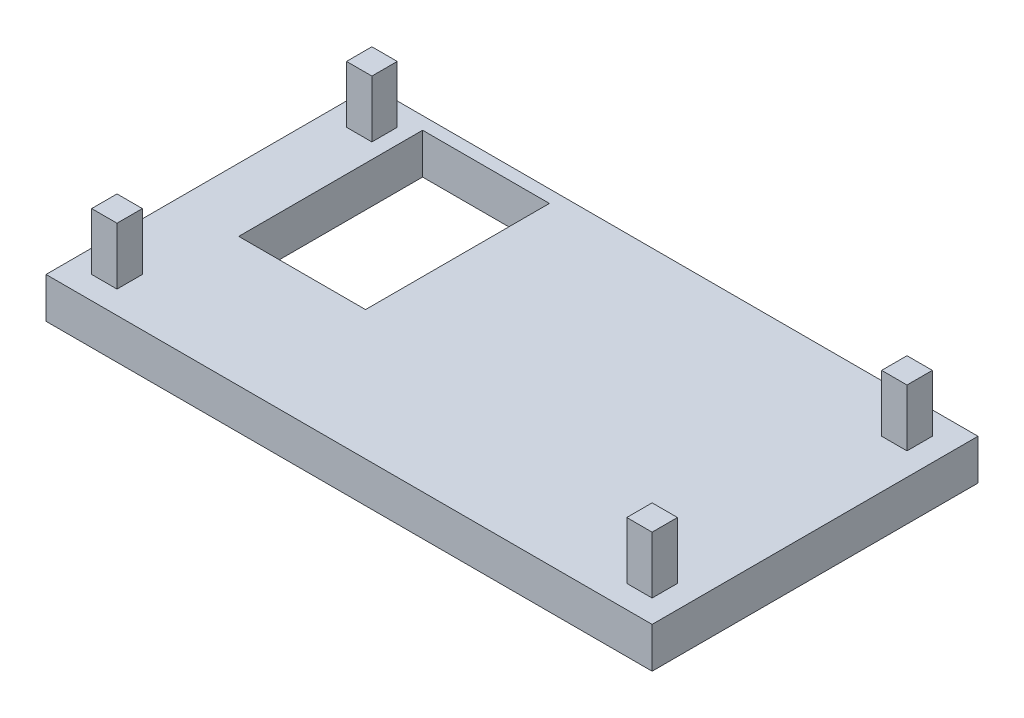
ISO-10303-21;
HEADER;
FILE_DESCRIPTION(('STEP AP214'),'2;1');
FILE_NAME('part.step','',(''),(''),'','','');
FILE_SCHEMA(('AUTOMOTIVE_DESIGN { 1 0 10303 214 1 1 1 1 }'));
ENDSEC;
DATA;
#1=APPLICATION_CONTEXT('core data for automotive mechanical design processes');
#2=APPLICATION_PROTOCOL_DEFINITION('international standard','automotive_design',2000,#1);
#3=PRODUCT_CONTEXT('',#1,'mechanical');
#4=PRODUCT('Part','Part','',(#3));
#5=PRODUCT_RELATED_PRODUCT_CATEGORY('part','',(#4));
#6=PRODUCT_DEFINITION_FORMATION('','',#4);
#7=PRODUCT_DEFINITION_CONTEXT('part definition',#1,'design');
#8=PRODUCT_DEFINITION('design','',#6,#7);
#9=PRODUCT_DEFINITION_SHAPE('','',#8);
#10=(LENGTH_UNIT() NAMED_UNIT(*) SI_UNIT(.MILLI.,.METRE.));
#11=(NAMED_UNIT(*) PLANE_ANGLE_UNIT() SI_UNIT($,.RADIAN.));
#12=(NAMED_UNIT(*) SI_UNIT($,.STERADIAN.) SOLID_ANGLE_UNIT());
#13=UNCERTAINTY_MEASURE_WITH_UNIT(LENGTH_MEASURE(1.E-05),#10,'distance_accuracy_value','');
#14=(GEOMETRIC_REPRESENTATION_CONTEXT(3) GLOBAL_UNCERTAINTY_ASSIGNED_CONTEXT((#13)) GLOBAL_UNIT_ASSIGNED_CONTEXT((#10,
#11,#12)) REPRESENTATION_CONTEXT('',''));
#15=CARTESIAN_POINT('',(0.,0.,0.));
#16=DIRECTION('',(0.,0.,1.));
#17=DIRECTION('',(1.,0.,0.));
#18=AXIS2_PLACEMENT_3D('',#15,#16,#17);
#19=CARTESIAN_POINT('',(0.,3.2,0.));
#20=DIRECTION('',(0.,-1.,0.));
#21=DIRECTION('',(0.,0.,-1.));
#22=AXIS2_PLACEMENT_3D('',#19,#20,#21);
#23=PLANE('',#22);
#24=DIRECTION('',(1.,0.,0.));
#25=VECTOR('',#24,1.);
#26=CARTESIAN_POINT('',(0.,3.2,-11.85));
#27=LINE('',#26,#25);
#28=CARTESIAN_POINT('',(-18.9,3.2,-11.85));
#29=VERTEX_POINT('',#28);
#30=CARTESIAN_POINT('',(-8.89999999999999,3.2,-11.85));
#31=VERTEX_POINT('',#30);
#32=EDGE_CURVE('E225',#29,#31,#27,.T.);
#33=ORIENTED_EDGE('',*,*,#32,.T.);
#34=DIRECTION('',(0.,0.,1.));
#35=VECTOR('',#34,1.);
#36=CARTESIAN_POINT('',(-8.89999999999999,3.2,0.));
#37=LINE('',#36,#35);
#38=CARTESIAN_POINT('',(-8.89999999999999,3.2,2.65));
#39=VERTEX_POINT('',#38);
#40=EDGE_CURVE('E228',#31,#39,#37,.T.);
#41=ORIENTED_EDGE('',*,*,#40,.T.);
#42=DIRECTION('',(-1.,0.,0.));
#43=VECTOR('',#42,1.);
#44=CARTESIAN_POINT('',(0.,3.2,2.65));
#45=LINE('',#44,#43);
#46=CARTESIAN_POINT('',(-18.9,3.2,2.65));
#47=VERTEX_POINT('',#46);
#48=EDGE_CURVE('E220',#39,#47,#45,.T.);
#49=ORIENTED_EDGE('',*,*,#48,.T.);
#50=DIRECTION('',(0.,0.,-1.));
#51=VECTOR('',#50,1.);
#52=CARTESIAN_POINT('',(-18.9,3.2,0.));
#53=LINE('',#52,#51);
#54=EDGE_CURVE('E200',#47,#29,#53,.T.);
#55=ORIENTED_EDGE('',*,*,#54,.T.);
#56=EDGE_LOOP('',(#33,#41,#49,#55));
#57=FACE_BOUND('',#56,.T.);
#58=DIRECTION('',(0.,0.,1.));
#59=VECTOR('',#58,1.);
#60=CARTESIAN_POINT('',(-22.1,3.2,-11.05));
#61=LINE('',#60,#59);
#62=CARTESIAN_POINT('',(-22.1,3.2,-11.05));
#63=VERTEX_POINT('',#62);
#64=CARTESIAN_POINT('',(-22.1,3.2,-9.04999999999999));
#65=VERTEX_POINT('',#64);
#66=EDGE_CURVE('E264',#63,#65,#61,.T.);
#67=ORIENTED_EDGE('',*,*,#66,.F.);
#68=DIRECTION('',(-1.,0.,0.));
#69=VECTOR('',#68,1.);
#70=CARTESIAN_POINT('',(-22.1,3.2,-11.05));
#71=LINE('',#70,#69);
#72=CARTESIAN_POINT('',(-20.1,3.2,-11.05));
#73=VERTEX_POINT('',#72);
#74=EDGE_CURVE('E269',#73,#63,#71,.T.);
#75=ORIENTED_EDGE('',*,*,#74,.F.);
#76=DIRECTION('',(0.,0.,-1.));
#77=VECTOR('',#76,1.);
#78=CARTESIAN_POINT('',(-20.1,3.2,-11.05));
#79=LINE('',#78,#77);
#80=CARTESIAN_POINT('',(-20.1,3.2,-9.04999999999999));
#81=VERTEX_POINT('',#80);
#82=EDGE_CURVE('E281',#81,#73,#79,.T.);
#83=ORIENTED_EDGE('',*,*,#82,.F.);
#84=DIRECTION('',(1.,0.,0.));
#85=VECTOR('',#84,1.);
#86=CARTESIAN_POINT('',(-22.1,3.2,-9.04999999999999));
#87=LINE('',#86,#85);
#88=EDGE_CURVE('E278',#65,#81,#87,.T.);
#89=ORIENTED_EDGE('',*,*,#88,.F.);
#90=EDGE_LOOP('',(#67,#75,#83,#89));
#91=FACE_BOUND('',#90,.T.);
#92=DIRECTION('',(0.,0.,1.));
#93=VECTOR('',#92,1.);
#94=CARTESIAN_POINT('',(20.1,3.2,11.05));
#95=LINE('',#94,#93);
#96=CARTESIAN_POINT('',(20.1,3.2,9.04999999999999));
#97=VERTEX_POINT('',#96);
#98=CARTESIAN_POINT('',(20.1,3.2,11.05));
#99=VERTEX_POINT('',#98);
#100=EDGE_CURVE('E330',#97,#99,#95,.T.);
#101=ORIENTED_EDGE('',*,*,#100,.F.);
#102=DIRECTION('',(-1.,0.,0.));
#103=VECTOR('',#102,1.);
#104=CARTESIAN_POINT('',(22.1,3.2,9.04999999999999));
#105=LINE('',#104,#103);
#106=CARTESIAN_POINT('',(22.1,3.2,9.04999999999999));
#107=VERTEX_POINT('',#106);
#108=EDGE_CURVE('E335',#107,#97,#105,.T.);
#109=ORIENTED_EDGE('',*,*,#108,.F.);
#110=DIRECTION('',(0.,0.,-1.));
#111=VECTOR('',#110,1.);
#112=CARTESIAN_POINT('',(22.1,3.2,11.05));
#113=LINE('',#112,#111);
#114=CARTESIAN_POINT('',(22.1,3.2,11.05));
#115=VERTEX_POINT('',#114);
#116=EDGE_CURVE('E347',#115,#107,#113,.T.);
#117=ORIENTED_EDGE('',*,*,#116,.F.);
#118=DIRECTION('',(1.,0.,0.));
#119=VECTOR('',#118,1.);
#120=CARTESIAN_POINT('',(22.1,3.2,11.05));
#121=LINE('',#120,#119);
#122=EDGE_CURVE('E344',#99,#115,#121,.T.);
#123=ORIENTED_EDGE('',*,*,#122,.F.);
#124=EDGE_LOOP('',(#101,#109,#117,#123));
#125=FACE_BOUND('',#124,.T.);
#126=DIRECTION('',(0.,0.,-1.));
#127=VECTOR('',#126,1.);
#128=CARTESIAN_POINT('',(23.9,3.2,12.85));
#129=LINE('',#128,#127);
#130=CARTESIAN_POINT('',(23.9,3.2,12.85));
#131=VERTEX_POINT('',#130);
#132=CARTESIAN_POINT('',(23.9,3.2,-12.85));
#133=VERTEX_POINT('',#132);
#134=EDGE_CURVE('E364',#131,#133,#129,.T.);
#135=ORIENTED_EDGE('',*,*,#134,.T.);
#136=DIRECTION('',(-1.,0.,0.));
#137=VECTOR('',#136,1.);
#138=CARTESIAN_POINT('',(-23.9,3.2,-12.85));
#139=LINE('',#138,#137);
#140=CARTESIAN_POINT('',(-23.9,3.2,-12.85));
#141=VERTEX_POINT('',#140);
#142=EDGE_CURVE('E367',#133,#141,#139,.T.);
#143=ORIENTED_EDGE('',*,*,#142,.T.);
#144=DIRECTION('',(0.,0.,1.));
#145=VECTOR('',#144,1.);
#146=CARTESIAN_POINT('',(-23.9,3.2,12.85));
#147=LINE('',#146,#145);
#148=CARTESIAN_POINT('',(-23.9,3.2,12.85));
#149=VERTEX_POINT('',#148);
#150=EDGE_CURVE('E370',#141,#149,#147,.T.);
#151=ORIENTED_EDGE('',*,*,#150,.T.);
#152=DIRECTION('',(1.,0.,0.));
#153=VECTOR('',#152,1.);
#154=CARTESIAN_POINT('',(-23.9,3.2,12.85));
#155=LINE('',#154,#153);
#156=EDGE_CURVE('E372',#149,#131,#155,.T.);
#157=ORIENTED_EDGE('',*,*,#156,.T.);
#158=EDGE_LOOP('',(#135,#143,#151,#157));
#159=FACE_BOUND('',#158,.T.);
#160=DIRECTION('',(0.,0.,-1.));
#161=VECTOR('',#160,1.);
#162=CARTESIAN_POINT('',(22.1,3.2,-11.05));
#163=LINE('',#162,#161);
#164=CARTESIAN_POINT('',(22.1,3.2,-9.04999999999999));
#165=VERTEX_POINT('',#164);
#166=CARTESIAN_POINT('',(22.1,3.2,-11.05));
#167=VERTEX_POINT('',#166);
#168=EDGE_CURVE('E297',#165,#167,#163,.T.);
#169=ORIENTED_EDGE('',*,*,#168,.F.);
#170=DIRECTION('',(1.,0.,0.));
#171=VECTOR('',#170,1.);
#172=CARTESIAN_POINT('',(22.1,3.2,-9.04999999999999));
#173=LINE('',#172,#171);
#174=CARTESIAN_POINT('',(20.1,3.2,-9.04999999999999));
#175=VERTEX_POINT('',#174);
#176=EDGE_CURVE('E302',#175,#165,#173,.T.);
#177=ORIENTED_EDGE('',*,*,#176,.F.);
#178=DIRECTION('',(0.,0.,1.));
#179=VECTOR('',#178,1.);
#180=CARTESIAN_POINT('',(20.1,3.2,-11.05));
#181=LINE('',#180,#179);
#182=CARTESIAN_POINT('',(20.1,3.2,-11.05));
#183=VERTEX_POINT('',#182);
#184=EDGE_CURVE('E314',#183,#175,#181,.T.);
#185=ORIENTED_EDGE('',*,*,#184,.F.);
#186=DIRECTION('',(-1.,0.,0.));
#187=VECTOR('',#186,1.);
#188=CARTESIAN_POINT('',(22.1,3.2,-11.05));
#189=LINE('',#188,#187);
#190=EDGE_CURVE('E311',#167,#183,#189,.T.);
#191=ORIENTED_EDGE('',*,*,#190,.F.);
#192=EDGE_LOOP('',(#169,#177,#185,#191));
#193=FACE_BOUND('',#192,.T.);
#194=DIRECTION('',(0.,0.,1.));
#195=VECTOR('',#194,1.);
#196=CARTESIAN_POINT('',(-22.1,3.2,11.05));
#197=LINE('',#196,#195);
#198=CARTESIAN_POINT('',(-22.1,3.2,9.05));
#199=VERTEX_POINT('',#198);
#200=CARTESIAN_POINT('',(-22.1,3.2,11.05));
#201=VERTEX_POINT('',#200);
#202=EDGE_CURVE('E231',#199,#201,#197,.T.);
#203=ORIENTED_EDGE('',*,*,#202,.F.);
#204=DIRECTION('',(-1.,0.,0.));
#205=VECTOR('',#204,1.);
#206=CARTESIAN_POINT('',(-22.1,3.2,9.05));
#207=LINE('',#206,#205);
#208=CARTESIAN_POINT('',(-20.1,3.2,9.05));
#209=VERTEX_POINT('',#208);
#210=EDGE_CURVE('E236',#209,#199,#207,.T.);
#211=ORIENTED_EDGE('',*,*,#210,.F.);
#212=DIRECTION('',(0.,0.,-1.));
#213=VECTOR('',#212,1.);
#214=CARTESIAN_POINT('',(-20.1,3.2,11.05));
#215=LINE('',#214,#213);
#216=CARTESIAN_POINT('',(-20.1,3.2,11.05));
#217=VERTEX_POINT('',#216);
#218=EDGE_CURVE('E248',#217,#209,#215,.T.);
#219=ORIENTED_EDGE('',*,*,#218,.F.);
#220=DIRECTION('',(1.,0.,0.));
#221=VECTOR('',#220,1.);
#222=CARTESIAN_POINT('',(-22.1,3.2,11.05));
#223=LINE('',#222,#221);
#224=EDGE_CURVE('E245',#201,#217,#223,.T.);
#225=ORIENTED_EDGE('',*,*,#224,.F.);
#226=EDGE_LOOP('',(#203,#211,#219,#225));
#227=FACE_BOUND('',#226,.T.);
#228=ADVANCED_FACE('F33',(#57,#91,#125,#159,#193,#227),#23,.F.);
#229=CARTESIAN_POINT('',(23.9,3.2,12.85));
#230=DIRECTION('',(-1.,0.,0.));
#231=DIRECTION('',(0.,0.,1.));
#232=AXIS2_PLACEMENT_3D('',#229,#230,#231);
#233=PLANE('',#232);
#234=DIRECTION('',(0.,0.,-1.));
#235=VECTOR('',#234,1.);
#236=CARTESIAN_POINT('',(23.9,0.,12.85));
#237=LINE('',#236,#235);
#238=CARTESIAN_POINT('',(23.9,0.,12.85));
#239=VERTEX_POINT('',#238);
#240=CARTESIAN_POINT('',(23.9,0.,-12.85));
#241=VERTEX_POINT('',#240);
#242=EDGE_CURVE('E363',#239,#241,#237,.T.);
#243=ORIENTED_EDGE('',*,*,#242,.T.);
#244=DIRECTION('',(0.,-1.,0.));
#245=VECTOR('',#244,1.);
#246=CARTESIAN_POINT('',(23.9,3.2,-12.85));
#247=LINE('',#246,#245);
#248=EDGE_CURVE('E11',#133,#241,#247,.T.);
#249=ORIENTED_EDGE('',*,*,#248,.F.);
#250=ORIENTED_EDGE('',*,*,#134,.F.);
#251=DIRECTION('',(0.,-1.,0.));
#252=VECTOR('',#251,1.);
#253=CARTESIAN_POINT('',(23.9,3.2,12.85));
#254=LINE('',#253,#252);
#255=EDGE_CURVE('E374',#131,#239,#254,.T.);
#256=ORIENTED_EDGE('',*,*,#255,.T.);
#257=EDGE_LOOP('',(#243,#249,#250,#256));
#258=FACE_BOUND('',#257,.T.);
#259=ADVANCED_FACE('F35',(#258),#233,.F.);
#260=CARTESIAN_POINT('',(-23.9,3.2,-12.85));
#261=DIRECTION('',(0.,0.,1.));
#262=DIRECTION('',(1.,0.,0.));
#263=AXIS2_PLACEMENT_3D('',#260,#261,#262);
#264=PLANE('',#263);
#265=DIRECTION('',(-1.,0.,0.));
#266=VECTOR('',#265,1.);
#267=CARTESIAN_POINT('',(-23.9,0.,-12.85));
#268=LINE('',#267,#266);
#269=CARTESIAN_POINT('',(-23.9,0.,-12.85));
#270=VERTEX_POINT('',#269);
#271=EDGE_CURVE('E377',#241,#270,#268,.T.);
#272=ORIENTED_EDGE('',*,*,#271,.T.);
#273=DIRECTION('',(0.,-1.,0.));
#274=VECTOR('',#273,1.);
#275=CARTESIAN_POINT('',(-23.9,3.2,-12.85));
#276=LINE('',#275,#274);
#277=EDGE_CURVE('E41',#141,#270,#276,.T.);
#278=ORIENTED_EDGE('',*,*,#277,.F.);
#279=ORIENTED_EDGE('',*,*,#142,.F.);
#280=ORIENTED_EDGE('',*,*,#248,.T.);
#281=EDGE_LOOP('',(#272,#278,#279,#280));
#282=FACE_BOUND('',#281,.T.);
#283=ADVANCED_FACE('F405',(#282),#264,.F.);
#284=CARTESIAN_POINT('',(-23.9,3.2,12.85));
#285=DIRECTION('',(1.,0.,0.));
#286=DIRECTION('',(0.,0.,-1.));
#287=AXIS2_PLACEMENT_3D('',#284,#285,#286);
#288=PLANE('',#287);
#289=DIRECTION('',(0.,0.,1.));
#290=VECTOR('',#289,1.);
#291=CARTESIAN_POINT('',(-23.9,0.,12.85));
#292=LINE('',#291,#290);
#293=CARTESIAN_POINT('',(-23.9,0.,12.85));
#294=VERTEX_POINT('',#293);
#295=EDGE_CURVE('E379',#270,#294,#292,.T.);
#296=ORIENTED_EDGE('',*,*,#295,.T.);
#297=DIRECTION('',(0.,-1.,0.));
#298=VECTOR('',#297,1.);
#299=CARTESIAN_POINT('',(-23.9,3.2,12.85));
#300=LINE('',#299,#298);
#301=EDGE_CURVE('E384',#149,#294,#300,.T.);
#302=ORIENTED_EDGE('',*,*,#301,.F.);
#303=ORIENTED_EDGE('',*,*,#150,.F.);
#304=ORIENTED_EDGE('',*,*,#277,.T.);
#305=EDGE_LOOP('',(#296,#302,#303,#304));
#306=FACE_BOUND('',#305,.T.);
#307=ADVANCED_FACE('F391',(#306),#288,.F.);
#308=CARTESIAN_POINT('',(-23.9,3.2,12.85));
#309=DIRECTION('',(0.,0.,-1.));
#310=DIRECTION('',(-1.,0.,0.));
#311=AXIS2_PLACEMENT_3D('',#308,#309,#310);
#312=PLANE('',#311);
#313=DIRECTION('',(1.,0.,0.));
#314=VECTOR('',#313,1.);
#315=CARTESIAN_POINT('',(-23.9,0.,12.85));
#316=LINE('',#315,#314);
#317=EDGE_CURVE('E368',#294,#239,#316,.T.);
#318=ORIENTED_EDGE('',*,*,#317,.T.);
#319=ORIENTED_EDGE('',*,*,#255,.F.);
#320=ORIENTED_EDGE('',*,*,#156,.F.);
#321=ORIENTED_EDGE('',*,*,#301,.T.);
#322=EDGE_LOOP('',(#318,#319,#320,#321));
#323=FACE_BOUND('',#322,.T.);
#324=ADVANCED_FACE('F398',(#323),#312,.F.);
#325=CARTESIAN_POINT('',(0.,0.,0.));
#326=DIRECTION('',(0.,-1.,0.));
#327=DIRECTION('',(0.,0.,-1.));
#328=AXIS2_PLACEMENT_3D('',#325,#326,#327);
#329=PLANE('',#328);
#330=DIRECTION('',(0.,0.,1.));
#331=VECTOR('',#330,1.);
#332=CARTESIAN_POINT('',(-8.89999999999999,0.,2.65));
#333=LINE('',#332,#331);
#334=CARTESIAN_POINT('',(-8.89999999999999,0.,-11.85));
#335=VERTEX_POINT('',#334);
#336=CARTESIAN_POINT('',(-8.89999999999999,0.,2.65));
#337=VERTEX_POINT('',#336);
#338=EDGE_CURVE('E56',#335,#337,#333,.T.);
#339=ORIENTED_EDGE('',*,*,#338,.F.);
#340=DIRECTION('',(1.,0.,0.));
#341=VECTOR('',#340,1.);
#342=CARTESIAN_POINT('',(-18.9,0.,-11.85));
#343=LINE('',#342,#341);
#344=CARTESIAN_POINT('',(-18.9,0.,-11.85));
#345=VERTEX_POINT('',#344);
#346=EDGE_CURVE('E213',#345,#335,#343,.T.);
#347=ORIENTED_EDGE('',*,*,#346,.F.);
#348=DIRECTION('',(0.,0.,-1.));
#349=VECTOR('',#348,1.);
#350=CARTESIAN_POINT('',(-18.9,0.,2.65));
#351=LINE('',#350,#349);
#352=CARTESIAN_POINT('',(-18.9,0.,2.65));
#353=VERTEX_POINT('',#352);
#354=EDGE_CURVE('E197',#353,#345,#351,.T.);
#355=ORIENTED_EDGE('',*,*,#354,.F.);
#356=DIRECTION('',(-1.,0.,0.));
#357=VECTOR('',#356,1.);
#358=CARTESIAN_POINT('',(-18.9,0.,2.65));
#359=LINE('',#358,#357);
#360=EDGE_CURVE('E206',#337,#353,#359,.T.);
#361=ORIENTED_EDGE('',*,*,#360,.F.);
#362=EDGE_LOOP('',(#339,#347,#355,#361));
#363=FACE_BOUND('',#362,.T.);
#364=ORIENTED_EDGE('',*,*,#242,.F.);
#365=ORIENTED_EDGE('',*,*,#317,.F.);
#366=ORIENTED_EDGE('',*,*,#295,.F.);
#367=ORIENTED_EDGE('',*,*,#271,.F.);
#368=EDGE_LOOP('',(#364,#365,#366,#367));
#369=FACE_BOUND('',#368,.T.);
#370=ADVANCED_FACE('F210',(#363,#369),#329,.T.);
#371=CARTESIAN_POINT('',(20.1,7.7,11.05));
#372=DIRECTION('',(1.,0.,0.));
#373=DIRECTION('',(0.,0.,-1.));
#374=AXIS2_PLACEMENT_3D('',#371,#372,#373);
#375=PLANE('',#374);
#376=ORIENTED_EDGE('',*,*,#100,.T.);
#377=DIRECTION('',(0.,-1.,0.));
#378=VECTOR('',#377,1.);
#379=CARTESIAN_POINT('',(20.1,7.7,11.05));
#380=LINE('',#379,#378);
#381=CARTESIAN_POINT('',(20.1,7.7,11.05));
#382=VERTEX_POINT('',#381);
#383=EDGE_CURVE('E360',#382,#99,#380,.T.);
#384=ORIENTED_EDGE('',*,*,#383,.F.);
#385=DIRECTION('',(0.,0.,1.));
#386=VECTOR('',#385,1.);
#387=CARTESIAN_POINT('',(20.1,7.7,11.05));
#388=LINE('',#387,#386);
#389=CARTESIAN_POINT('',(20.1,7.7,9.04999999999999));
#390=VERTEX_POINT('',#389);
#391=EDGE_CURVE('E331',#390,#382,#388,.T.);
#392=ORIENTED_EDGE('',*,*,#391,.F.);
#393=DIRECTION('',(0.,-1.,0.));
#394=VECTOR('',#393,1.);
#395=CARTESIAN_POINT('',(20.1,7.7,9.04999999999999));
#396=LINE('',#395,#394);
#397=EDGE_CURVE('E341',#390,#97,#396,.T.);
#398=ORIENTED_EDGE('',*,*,#397,.T.);
#399=EDGE_LOOP('',(#376,#384,#392,#398));
#400=FACE_BOUND('',#399,.T.);
#401=ADVANCED_FACE('F420',(#400),#375,.F.);
#402=CARTESIAN_POINT('',(22.1,7.7,11.05));
#403=DIRECTION('',(0.,0.,-1.));
#404=DIRECTION('',(-1.,0.,0.));
#405=AXIS2_PLACEMENT_3D('',#402,#403,#404);
#406=PLANE('',#405);
#407=ORIENTED_EDGE('',*,*,#122,.T.);
#408=DIRECTION('',(0.,-1.,0.));
#409=VECTOR('',#408,1.);
#410=CARTESIAN_POINT('',(22.1,7.7,11.05));
#411=LINE('',#410,#409);
#412=CARTESIAN_POINT('',(22.1,7.7,11.05));
#413=VERTEX_POINT('',#412);
#414=EDGE_CURVE('E357',#413,#115,#411,.T.);
#415=ORIENTED_EDGE('',*,*,#414,.F.);
#416=DIRECTION('',(1.,0.,0.));
#417=VECTOR('',#416,1.);
#418=CARTESIAN_POINT('',(22.1,7.7,11.05));
#419=LINE('',#418,#417);
#420=EDGE_CURVE('E334',#382,#413,#419,.T.);
#421=ORIENTED_EDGE('',*,*,#420,.F.);
#422=ORIENTED_EDGE('',*,*,#383,.T.);
#423=EDGE_LOOP('',(#407,#415,#421,#422));
#424=FACE_BOUND('',#423,.T.);
#425=ADVANCED_FACE('F440',(#424),#406,.F.);
#426=CARTESIAN_POINT('',(22.1,7.7,11.05));
#427=DIRECTION('',(-1.,0.,0.));
#428=DIRECTION('',(0.,0.,1.));
#429=AXIS2_PLACEMENT_3D('',#426,#427,#428);
#430=PLANE('',#429);
#431=ORIENTED_EDGE('',*,*,#116,.T.);
#432=DIRECTION('',(0.,-1.,0.));
#433=VECTOR('',#432,1.);
#434=CARTESIAN_POINT('',(22.1,7.7,9.04999999999999));
#435=LINE('',#434,#433);
#436=CARTESIAN_POINT('',(22.1,7.7,9.04999999999999));
#437=VERTEX_POINT('',#436);
#438=EDGE_CURVE('E354',#437,#107,#435,.T.);
#439=ORIENTED_EDGE('',*,*,#438,.F.);
#440=DIRECTION('',(0.,0.,-1.));
#441=VECTOR('',#440,1.);
#442=CARTESIAN_POINT('',(22.1,7.7,11.05));
#443=LINE('',#442,#441);
#444=EDGE_CURVE('E337',#413,#437,#443,.T.);
#445=ORIENTED_EDGE('',*,*,#444,.F.);
#446=ORIENTED_EDGE('',*,*,#414,.T.);
#447=EDGE_LOOP('',(#431,#439,#445,#446));
#448=FACE_BOUND('',#447,.T.);
#449=ADVANCED_FACE('F447',(#448),#430,.F.);
#450=CARTESIAN_POINT('',(22.1,7.7,9.04999999999999));
#451=DIRECTION('',(0.,0.,1.));
#452=DIRECTION('',(1.,0.,0.));
#453=AXIS2_PLACEMENT_3D('',#450,#451,#452);
#454=PLANE('',#453);
#455=ORIENTED_EDGE('',*,*,#108,.T.);
#456=ORIENTED_EDGE('',*,*,#397,.F.);
#457=DIRECTION('',(-1.,0.,0.));
#458=VECTOR('',#457,1.);
#459=CARTESIAN_POINT('',(22.1,7.7,9.04999999999999));
#460=LINE('',#459,#458);
#461=EDGE_CURVE('E339',#437,#390,#460,.T.);
#462=ORIENTED_EDGE('',*,*,#461,.F.);
#463=ORIENTED_EDGE('',*,*,#438,.T.);
#464=EDGE_LOOP('',(#455,#456,#462,#463));
#465=FACE_BOUND('',#464,.T.);
#466=ADVANCED_FACE('F454',(#465),#454,.F.);
#467=CARTESIAN_POINT('',(0.,7.7,0.));
#468=DIRECTION('',(0.,1.,0.));
#469=DIRECTION('',(0.,0.,1.));
#470=AXIS2_PLACEMENT_3D('',#467,#468,#469);
#471=PLANE('',#470);
#472=ORIENTED_EDGE('',*,*,#391,.T.);
#473=ORIENTED_EDGE('',*,*,#420,.T.);
#474=ORIENTED_EDGE('',*,*,#444,.T.);
#475=ORIENTED_EDGE('',*,*,#461,.T.);
#476=EDGE_LOOP('',(#472,#473,#474,#475));
#477=FACE_BOUND('',#476,.T.);
#478=ADVANCED_FACE('F462',(#477),#471,.T.);
#479=CARTESIAN_POINT('',(22.1,7.7,-11.05));
#480=DIRECTION('',(-1.,0.,0.));
#481=DIRECTION('',(0.,0.,1.));
#482=AXIS2_PLACEMENT_3D('',#479,#480,#481);
#483=PLANE('',#482);
#484=ORIENTED_EDGE('',*,*,#168,.T.);
#485=DIRECTION('',(0.,-1.,0.));
#486=VECTOR('',#485,1.);
#487=CARTESIAN_POINT('',(22.1,7.7,-11.05));
#488=LINE('',#487,#486);
#489=CARTESIAN_POINT('',(22.1,7.7,-11.05));
#490=VERTEX_POINT('',#489);
#491=EDGE_CURVE('E327',#490,#167,#488,.T.);
#492=ORIENTED_EDGE('',*,*,#491,.F.);
#493=DIRECTION('',(0.,0.,-1.));
#494=VECTOR('',#493,1.);
#495=CARTESIAN_POINT('',(22.1,7.7,-11.05));
#496=LINE('',#495,#494);
#497=CARTESIAN_POINT('',(22.1,7.7,-9.04999999999999));
#498=VERTEX_POINT('',#497);
#499=EDGE_CURVE('E298',#498,#490,#496,.T.);
#500=ORIENTED_EDGE('',*,*,#499,.F.);
#501=DIRECTION('',(0.,-1.,0.));
#502=VECTOR('',#501,1.);
#503=CARTESIAN_POINT('',(22.1,7.7,-9.04999999999999));
#504=LINE('',#503,#502);
#505=EDGE_CURVE('E308',#498,#165,#504,.T.);
#506=ORIENTED_EDGE('',*,*,#505,.T.);
#507=EDGE_LOOP('',(#484,#492,#500,#506));
#508=FACE_BOUND('',#507,.T.);
#509=ADVANCED_FACE('F470',(#508),#483,.F.);
#510=CARTESIAN_POINT('',(22.1,7.7,-11.05));
#511=DIRECTION('',(0.,0.,1.));
#512=DIRECTION('',(1.,0.,0.));
#513=AXIS2_PLACEMENT_3D('',#510,#511,#512);
#514=PLANE('',#513);
#515=ORIENTED_EDGE('',*,*,#190,.T.);
#516=DIRECTION('',(0.,-1.,0.));
#517=VECTOR('',#516,1.);
#518=CARTESIAN_POINT('',(20.1,7.7,-11.05));
#519=LINE('',#518,#517);
#520=CARTESIAN_POINT('',(20.1,7.7,-11.05));
#521=VERTEX_POINT('',#520);
#522=EDGE_CURVE('E324',#521,#183,#519,.T.);
#523=ORIENTED_EDGE('',*,*,#522,.F.);
#524=DIRECTION('',(-1.,0.,0.));
#525=VECTOR('',#524,1.);
#526=CARTESIAN_POINT('',(22.1,7.7,-11.05));
#527=LINE('',#526,#525);
#528=EDGE_CURVE('E301',#490,#521,#527,.T.);
#529=ORIENTED_EDGE('',*,*,#528,.F.);
#530=ORIENTED_EDGE('',*,*,#491,.T.);
#531=EDGE_LOOP('',(#515,#523,#529,#530));
#532=FACE_BOUND('',#531,.T.);
#533=ADVANCED_FACE('F478',(#532),#514,.F.);
#534=CARTESIAN_POINT('',(20.1,7.7,-11.05));
#535=DIRECTION('',(1.,0.,0.));
#536=DIRECTION('',(0.,0.,-1.));
#537=AXIS2_PLACEMENT_3D('',#534,#535,#536);
#538=PLANE('',#537);
#539=ORIENTED_EDGE('',*,*,#184,.T.);
#540=DIRECTION('',(0.,-1.,0.));
#541=VECTOR('',#540,1.);
#542=CARTESIAN_POINT('',(20.1,7.7,-9.04999999999999));
#543=LINE('',#542,#541);
#544=CARTESIAN_POINT('',(20.1,7.7,-9.04999999999999));
#545=VERTEX_POINT('',#544);
#546=EDGE_CURVE('E321',#545,#175,#543,.T.);
#547=ORIENTED_EDGE('',*,*,#546,.F.);
#548=DIRECTION('',(0.,0.,1.));
#549=VECTOR('',#548,1.);
#550=CARTESIAN_POINT('',(20.1,7.7,-11.05));
#551=LINE('',#550,#549);
#552=EDGE_CURVE('E304',#521,#545,#551,.T.);
#553=ORIENTED_EDGE('',*,*,#552,.F.);
#554=ORIENTED_EDGE('',*,*,#522,.T.);
#555=EDGE_LOOP('',(#539,#547,#553,#554));
#556=FACE_BOUND('',#555,.T.);
#557=ADVANCED_FACE('F486',(#556),#538,.F.);
#558=CARTESIAN_POINT('',(22.1,7.7,-9.04999999999999));
#559=DIRECTION('',(0.,0.,-1.));
#560=DIRECTION('',(-1.,0.,0.));
#561=AXIS2_PLACEMENT_3D('',#558,#559,#560);
#562=PLANE('',#561);
#563=ORIENTED_EDGE('',*,*,#176,.T.);
#564=ORIENTED_EDGE('',*,*,#505,.F.);
#565=DIRECTION('',(1.,0.,0.));
#566=VECTOR('',#565,1.);
#567=CARTESIAN_POINT('',(22.1,7.7,-9.04999999999999));
#568=LINE('',#567,#566);
#569=EDGE_CURVE('E306',#545,#498,#568,.T.);
#570=ORIENTED_EDGE('',*,*,#569,.F.);
#571=ORIENTED_EDGE('',*,*,#546,.T.);
#572=EDGE_LOOP('',(#563,#564,#570,#571));
#573=FACE_BOUND('',#572,.T.);
#574=ADVANCED_FACE('F494',(#573),#562,.F.);
#575=CARTESIAN_POINT('',(0.,7.7,0.));
#576=DIRECTION('',(0.,-1.,0.));
#577=DIRECTION('',(0.,0.,-1.));
#578=AXIS2_PLACEMENT_3D('',#575,#576,#577);
#579=PLANE('',#578);
#580=ORIENTED_EDGE('',*,*,#499,.T.);
#581=ORIENTED_EDGE('',*,*,#528,.T.);
#582=ORIENTED_EDGE('',*,*,#552,.T.);
#583=ORIENTED_EDGE('',*,*,#569,.T.);
#584=EDGE_LOOP('',(#580,#581,#582,#583));
#585=FACE_BOUND('',#584,.T.);
#586=ADVANCED_FACE('F502',(#585),#579,.F.);
#587=CARTESIAN_POINT('',(-22.1,7.7,-11.05));
#588=DIRECTION('',(1.,0.,0.));
#589=DIRECTION('',(0.,0.,-1.));
#590=AXIS2_PLACEMENT_3D('',#587,#588,#589);
#591=PLANE('',#590);
#592=ORIENTED_EDGE('',*,*,#66,.T.);
#593=DIRECTION('',(0.,-1.,0.));
#594=VECTOR('',#593,1.);
#595=CARTESIAN_POINT('',(-22.1,7.7,-9.04999999999999));
#596=LINE('',#595,#594);
#597=CARTESIAN_POINT('',(-22.1,7.7,-9.04999999999999));
#598=VERTEX_POINT('',#597);
#599=EDGE_CURVE('E294',#598,#65,#596,.T.);
#600=ORIENTED_EDGE('',*,*,#599,.F.);
#601=DIRECTION('',(0.,0.,1.));
#602=VECTOR('',#601,1.);
#603=CARTESIAN_POINT('',(-22.1,7.7,-11.05));
#604=LINE('',#603,#602);
#605=CARTESIAN_POINT('',(-22.1,7.7,-11.05));
#606=VERTEX_POINT('',#605);
#607=EDGE_CURVE('E265',#606,#598,#604,.T.);
#608=ORIENTED_EDGE('',*,*,#607,.F.);
#609=DIRECTION('',(0.,-1.,0.));
#610=VECTOR('',#609,1.);
#611=CARTESIAN_POINT('',(-22.1,7.7,-11.05));
#612=LINE('',#611,#610);
#613=EDGE_CURVE('E275',#606,#63,#612,.T.);
#614=ORIENTED_EDGE('',*,*,#613,.T.);
#615=EDGE_LOOP('',(#592,#600,#608,#614));
#616=FACE_BOUND('',#615,.T.);
#617=ADVANCED_FACE('F510',(#616),#591,.F.);
#618=CARTESIAN_POINT('',(-22.1,7.7,-9.04999999999999));
#619=DIRECTION('',(0.,0.,-1.));
#620=DIRECTION('',(-1.,0.,0.));
#621=AXIS2_PLACEMENT_3D('',#618,#619,#620);
#622=PLANE('',#621);
#623=ORIENTED_EDGE('',*,*,#88,.T.);
#624=DIRECTION('',(0.,-1.,0.));
#625=VECTOR('',#624,1.);
#626=CARTESIAN_POINT('',(-20.1,7.7,-9.04999999999999));
#627=LINE('',#626,#625);
#628=CARTESIAN_POINT('',(-20.1,7.7,-9.04999999999999));
#629=VERTEX_POINT('',#628);
#630=EDGE_CURVE('E291',#629,#81,#627,.T.);
#631=ORIENTED_EDGE('',*,*,#630,.F.);
#632=DIRECTION('',(1.,0.,0.));
#633=VECTOR('',#632,1.);
#634=CARTESIAN_POINT('',(-22.1,7.7,-9.04999999999999));
#635=LINE('',#634,#633);
#636=EDGE_CURVE('E268',#598,#629,#635,.T.);
#637=ORIENTED_EDGE('',*,*,#636,.F.);
#638=ORIENTED_EDGE('',*,*,#599,.T.);
#639=EDGE_LOOP('',(#623,#631,#637,#638));
#640=FACE_BOUND('',#639,.T.);
#641=ADVANCED_FACE('F518',(#640),#622,.F.);
#642=CARTESIAN_POINT('',(-20.1,7.7,-11.05));
#643=DIRECTION('',(-1.,0.,0.));
#644=DIRECTION('',(0.,0.,1.));
#645=AXIS2_PLACEMENT_3D('',#642,#643,#644);
#646=PLANE('',#645);
#647=ORIENTED_EDGE('',*,*,#82,.T.);
#648=DIRECTION('',(0.,-1.,0.));
#649=VECTOR('',#648,1.);
#650=CARTESIAN_POINT('',(-20.1,7.7,-11.05));
#651=LINE('',#650,#649);
#652=CARTESIAN_POINT('',(-20.1,7.7,-11.05));
#653=VERTEX_POINT('',#652);
#654=EDGE_CURVE('E288',#653,#73,#651,.T.);
#655=ORIENTED_EDGE('',*,*,#654,.F.);
#656=DIRECTION('',(0.,0.,-1.));
#657=VECTOR('',#656,1.);
#658=CARTESIAN_POINT('',(-20.1,7.7,-11.05));
#659=LINE('',#658,#657);
#660=EDGE_CURVE('E271',#629,#653,#659,.T.);
#661=ORIENTED_EDGE('',*,*,#660,.F.);
#662=ORIENTED_EDGE('',*,*,#630,.T.);
#663=EDGE_LOOP('',(#647,#655,#661,#662));
#664=FACE_BOUND('',#663,.T.);
#665=ADVANCED_FACE('F526',(#664),#646,.F.);
#666=CARTESIAN_POINT('',(-22.1,7.7,-11.05));
#667=DIRECTION('',(0.,0.,1.));
#668=DIRECTION('',(1.,0.,0.));
#669=AXIS2_PLACEMENT_3D('',#666,#667,#668);
#670=PLANE('',#669);
#671=ORIENTED_EDGE('',*,*,#74,.T.);
#672=ORIENTED_EDGE('',*,*,#613,.F.);
#673=DIRECTION('',(-1.,0.,0.));
#674=VECTOR('',#673,1.);
#675=CARTESIAN_POINT('',(-22.1,7.7,-11.05));
#676=LINE('',#675,#674);
#677=EDGE_CURVE('E273',#653,#606,#676,.T.);
#678=ORIENTED_EDGE('',*,*,#677,.F.);
#679=ORIENTED_EDGE('',*,*,#654,.T.);
#680=EDGE_LOOP('',(#671,#672,#678,#679));
#681=FACE_BOUND('',#680,.T.);
#682=ADVANCED_FACE('F534',(#681),#670,.F.);
#683=CARTESIAN_POINT('',(0.,7.7,0.));
#684=DIRECTION('',(0.,1.,0.));
#685=DIRECTION('',(0.,0.,1.));
#686=AXIS2_PLACEMENT_3D('',#683,#684,#685);
#687=PLANE('',#686);
#688=ORIENTED_EDGE('',*,*,#607,.T.);
#689=ORIENTED_EDGE('',*,*,#636,.T.);
#690=ORIENTED_EDGE('',*,*,#660,.T.);
#691=ORIENTED_EDGE('',*,*,#677,.T.);
#692=EDGE_LOOP('',(#688,#689,#690,#691));
#693=FACE_BOUND('',#692,.T.);
#694=ADVANCED_FACE('F542',(#693),#687,.T.);
#695=CARTESIAN_POINT('',(-22.1,7.7,11.05));
#696=DIRECTION('',(1.,0.,0.));
#697=DIRECTION('',(0.,0.,-1.));
#698=AXIS2_PLACEMENT_3D('',#695,#696,#697);
#699=PLANE('',#698);
#700=ORIENTED_EDGE('',*,*,#202,.T.);
#701=DIRECTION('',(0.,-1.,0.));
#702=VECTOR('',#701,1.);
#703=CARTESIAN_POINT('',(-22.1,7.7,11.05));
#704=LINE('',#703,#702);
#705=CARTESIAN_POINT('',(-22.1,7.7,11.05));
#706=VERTEX_POINT('',#705);
#707=EDGE_CURVE('E261',#706,#201,#704,.T.);
#708=ORIENTED_EDGE('',*,*,#707,.F.);
#709=DIRECTION('',(0.,0.,1.));
#710=VECTOR('',#709,1.);
#711=CARTESIAN_POINT('',(-22.1,7.7,11.05));
#712=LINE('',#711,#710);
#713=CARTESIAN_POINT('',(-22.1,7.7,9.05));
#714=VERTEX_POINT('',#713);
#715=EDGE_CURVE('E232',#714,#706,#712,.T.);
#716=ORIENTED_EDGE('',*,*,#715,.F.);
#717=DIRECTION('',(0.,-1.,0.));
#718=VECTOR('',#717,1.);
#719=CARTESIAN_POINT('',(-22.1,7.7,9.05));
#720=LINE('',#719,#718);
#721=EDGE_CURVE('E242',#714,#199,#720,.T.);
#722=ORIENTED_EDGE('',*,*,#721,.T.);
#723=EDGE_LOOP('',(#700,#708,#716,#722));
#724=FACE_BOUND('',#723,.T.);
#725=ADVANCED_FACE('F550',(#724),#699,.F.);
#726=CARTESIAN_POINT('',(-22.1,7.7,11.05));
#727=DIRECTION('',(0.,0.,-1.));
#728=DIRECTION('',(-1.,0.,0.));
#729=AXIS2_PLACEMENT_3D('',#726,#727,#728);
#730=PLANE('',#729);
#731=ORIENTED_EDGE('',*,*,#224,.T.);
#732=DIRECTION('',(0.,-1.,0.));
#733=VECTOR('',#732,1.);
#734=CARTESIAN_POINT('',(-20.1,7.7,11.05));
#735=LINE('',#734,#733);
#736=CARTESIAN_POINT('',(-20.1,7.7,11.05));
#737=VERTEX_POINT('',#736);
#738=EDGE_CURVE('E258',#737,#217,#735,.T.);
#739=ORIENTED_EDGE('',*,*,#738,.F.);
#740=DIRECTION('',(1.,0.,0.));
#741=VECTOR('',#740,1.);
#742=CARTESIAN_POINT('',(-22.1,7.7,11.05));
#743=LINE('',#742,#741);
#744=EDGE_CURVE('E235',#706,#737,#743,.T.);
#745=ORIENTED_EDGE('',*,*,#744,.F.);
#746=ORIENTED_EDGE('',*,*,#707,.T.);
#747=EDGE_LOOP('',(#731,#739,#745,#746));
#748=FACE_BOUND('',#747,.T.);
#749=ADVANCED_FACE('F558',(#748),#730,.F.);
#750=CARTESIAN_POINT('',(-20.1,7.7,11.05));
#751=DIRECTION('',(-1.,0.,0.));
#752=DIRECTION('',(0.,0.,1.));
#753=AXIS2_PLACEMENT_3D('',#750,#751,#752);
#754=PLANE('',#753);
#755=ORIENTED_EDGE('',*,*,#218,.T.);
#756=DIRECTION('',(0.,-1.,0.));
#757=VECTOR('',#756,1.);
#758=CARTESIAN_POINT('',(-20.1,7.7,9.05));
#759=LINE('',#758,#757);
#760=CARTESIAN_POINT('',(-20.1,7.7,9.05));
#761=VERTEX_POINT('',#760);
#762=EDGE_CURVE('E255',#761,#209,#759,.T.);
#763=ORIENTED_EDGE('',*,*,#762,.F.);
#764=DIRECTION('',(0.,0.,-1.));
#765=VECTOR('',#764,1.);
#766=CARTESIAN_POINT('',(-20.1,7.7,11.05));
#767=LINE('',#766,#765);
#768=EDGE_CURVE('E238',#737,#761,#767,.T.);
#769=ORIENTED_EDGE('',*,*,#768,.F.);
#770=ORIENTED_EDGE('',*,*,#738,.T.);
#771=EDGE_LOOP('',(#755,#763,#769,#770));
#772=FACE_BOUND('',#771,.T.);
#773=ADVANCED_FACE('F566',(#772),#754,.F.);
#774=CARTESIAN_POINT('',(-22.1,7.7,9.05));
#775=DIRECTION('',(0.,0.,1.));
#776=DIRECTION('',(1.,0.,0.));
#777=AXIS2_PLACEMENT_3D('',#774,#775,#776);
#778=PLANE('',#777);
#779=ORIENTED_EDGE('',*,*,#210,.T.);
#780=ORIENTED_EDGE('',*,*,#721,.F.);
#781=DIRECTION('',(-1.,0.,0.));
#782=VECTOR('',#781,1.);
#783=CARTESIAN_POINT('',(-22.1,7.7,9.05));
#784=LINE('',#783,#782);
#785=EDGE_CURVE('E240',#761,#714,#784,.T.);
#786=ORIENTED_EDGE('',*,*,#785,.F.);
#787=ORIENTED_EDGE('',*,*,#762,.T.);
#788=EDGE_LOOP('',(#779,#780,#786,#787));
#789=FACE_BOUND('',#788,.T.);
#790=ADVANCED_FACE('F574',(#789),#778,.F.);
#791=CARTESIAN_POINT('',(0.,7.7,0.));
#792=DIRECTION('',(0.,-1.,0.));
#793=DIRECTION('',(0.,0.,-1.));
#794=AXIS2_PLACEMENT_3D('',#791,#792,#793);
#795=PLANE('',#794);
#796=ORIENTED_EDGE('',*,*,#715,.T.);
#797=ORIENTED_EDGE('',*,*,#744,.T.);
#798=ORIENTED_EDGE('',*,*,#768,.T.);
#799=ORIENTED_EDGE('',*,*,#785,.T.);
#800=EDGE_LOOP('',(#796,#797,#798,#799));
#801=FACE_BOUND('',#800,.T.);
#802=ADVANCED_FACE('F582',(#801),#795,.F.);
#803=CARTESIAN_POINT('',(-8.89999999999999,5.,2.65));
#804=DIRECTION('',(1.,0.,0.));
#805=DIRECTION('',(0.,0.,-1.));
#806=AXIS2_PLACEMENT_3D('',#803,#804,#805);
#807=PLANE('',#806);
#808=DIRECTION('',(0.,-1.,0.));
#809=VECTOR('',#808,1.);
#810=CARTESIAN_POINT('',(-8.89999999999999,5.,-11.85));
#811=LINE('',#810,#809);
#812=EDGE_CURVE('E218',#31,#335,#811,.T.);
#813=ORIENTED_EDGE('',*,*,#812,.T.);
#814=ORIENTED_EDGE('',*,*,#338,.T.);
#815=DIRECTION('',(0.,-1.,0.));
#816=VECTOR('',#815,1.);
#817=CARTESIAN_POINT('',(-8.89999999999999,5.,2.65));
#818=LINE('',#817,#816);
#819=EDGE_CURVE('E203',#39,#337,#818,.T.);
#820=ORIENTED_EDGE('',*,*,#819,.F.);
#821=ORIENTED_EDGE('',*,*,#40,.F.);
#822=EDGE_LOOP('',(#813,#814,#820,#821));
#823=FACE_BOUND('',#822,.T.);
#824=ADVANCED_FACE('F590',(#823),#807,.F.);
#825=CARTESIAN_POINT('',(-18.9,5.,-11.85));
#826=DIRECTION('',(0.,0.,-1.));
#827=DIRECTION('',(-1.,0.,0.));
#828=AXIS2_PLACEMENT_3D('',#825,#826,#827);
#829=PLANE('',#828);
#830=DIRECTION('',(0.,-1.,0.));
#831=VECTOR('',#830,1.);
#832=CARTESIAN_POINT('',(-18.9,5.,-11.85));
#833=LINE('',#832,#831);
#834=EDGE_CURVE('E202',#29,#345,#833,.T.);
#835=ORIENTED_EDGE('',*,*,#834,.T.);
#836=ORIENTED_EDGE('',*,*,#346,.T.);
#837=ORIENTED_EDGE('',*,*,#812,.F.);
#838=ORIENTED_EDGE('',*,*,#32,.F.);
#839=EDGE_LOOP('',(#835,#836,#837,#838));
#840=FACE_BOUND('',#839,.T.);
#841=ADVANCED_FACE('F597',(#840),#829,.F.);
#842=CARTESIAN_POINT('',(-18.9,5.,2.65));
#843=DIRECTION('',(-1.,0.,0.));
#844=DIRECTION('',(0.,0.,1.));
#845=AXIS2_PLACEMENT_3D('',#842,#843,#844);
#846=PLANE('',#845);
#847=DIRECTION('',(0.,-1.,0.));
#848=VECTOR('',#847,1.);
#849=CARTESIAN_POINT('',(-18.9,5.,2.65));
#850=LINE('',#849,#848);
#851=EDGE_CURVE('E48',#47,#353,#850,.T.);
#852=ORIENTED_EDGE('',*,*,#851,.T.);
#853=ORIENTED_EDGE('',*,*,#354,.T.);
#854=ORIENTED_EDGE('',*,*,#834,.F.);
#855=ORIENTED_EDGE('',*,*,#54,.F.);
#856=EDGE_LOOP('',(#852,#853,#854,#855));
#857=FACE_BOUND('',#856,.T.);
#858=ADVANCED_FACE('F194',(#857),#846,.F.);
#859=CARTESIAN_POINT('',(-18.9,5.,2.65));
#860=DIRECTION('',(0.,0.,1.));
#861=DIRECTION('',(1.,0.,0.));
#862=AXIS2_PLACEMENT_3D('',#859,#860,#861);
#863=PLANE('',#862);
#864=ORIENTED_EDGE('',*,*,#819,.T.);
#865=ORIENTED_EDGE('',*,*,#360,.T.);
#866=ORIENTED_EDGE('',*,*,#851,.F.);
#867=ORIENTED_EDGE('',*,*,#48,.F.);
#868=EDGE_LOOP('',(#864,#865,#866,#867));
#869=FACE_BOUND('',#868,.T.);
#870=ADVANCED_FACE('F207',(#869),#863,.F.);
#871=CLOSED_SHELL('',(#228,#259,#283,#307,#324,#370,#401,#425,#449,#466,#478,#509,#533,#557,
#574,#586,#617,#641,#665,#682,#694,#725,#749,#773,#790,#802,#824,#841,#858,#870));
#872=MANIFOLD_SOLID_BREP('B2',#871);
#873=ADVANCED_BREP_SHAPE_REPRESENTATION('',(#18,#872),#14);
#874=SHAPE_DEFINITION_REPRESENTATION(#9,#873);
ENDSEC;
END-ISO-10303-21;
